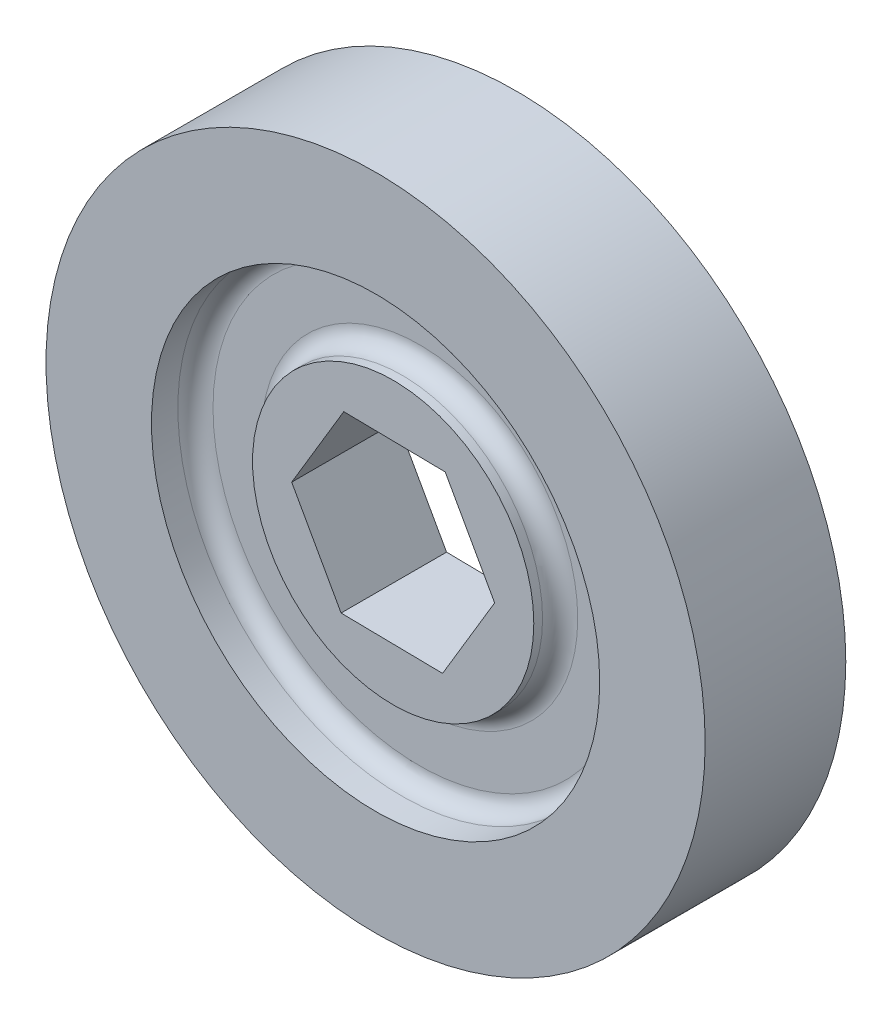
ISO-10303-21;
HEADER;
FILE_DESCRIPTION(('STEP AP214'),'2;1');
FILE_NAME('part.step','',(''),(''),'','','');
FILE_SCHEMA(('AUTOMOTIVE_DESIGN { 1 0 10303 214 1 1 1 1 }'));
ENDSEC;
DATA;
#1=APPLICATION_CONTEXT('core data for automotive mechanical design processes');
#2=APPLICATION_PROTOCOL_DEFINITION('international standard','automotive_design',2000,#1);
#3=PRODUCT_CONTEXT('',#1,'mechanical');
#4=PRODUCT('Part','Part','',(#3));
#5=PRODUCT_RELATED_PRODUCT_CATEGORY('part','',(#4));
#6=PRODUCT_DEFINITION_FORMATION('','',#4);
#7=PRODUCT_DEFINITION_CONTEXT('part definition',#1,'design');
#8=PRODUCT_DEFINITION('design','',#6,#7);
#9=PRODUCT_DEFINITION_SHAPE('','',#8);
#10=(LENGTH_UNIT() NAMED_UNIT(*) SI_UNIT(.MILLI.,.METRE.));
#11=(NAMED_UNIT(*) PLANE_ANGLE_UNIT() SI_UNIT($,.RADIAN.));
#12=(NAMED_UNIT(*) SI_UNIT($,.STERADIAN.) SOLID_ANGLE_UNIT());
#13=UNCERTAINTY_MEASURE_WITH_UNIT(LENGTH_MEASURE(1.E-05),#10,'distance_accuracy_value','');
#14=(GEOMETRIC_REPRESENTATION_CONTEXT(3) GLOBAL_UNCERTAINTY_ASSIGNED_CONTEXT((#13)) GLOBAL_UNIT_ASSIGNED_CONTEXT((#10,
#11,#12)) REPRESENTATION_CONTEXT('',''));
#15=CARTESIAN_POINT('',(0.,0.,0.));
#16=DIRECTION('',(0.,0.,1.));
#17=DIRECTION('',(1.,0.,0.));
#18=AXIS2_PLACEMENT_3D('',#15,#16,#17);
#19=CARTESIAN_POINT('',(-3.76226704796302,-6.29354272196074,10.16));
#20=DIRECTION('',(0.0151994247971552,0.999884482070722,0.));
#21=DIRECTION('',(-0.999884482070722,0.0151994247971552,0.));
#22=AXIS2_PLACEMENT_3D('',#19,#20,#21);
#23=PLANE('',#22);
#24=DIRECTION('',(0.,0.,-1.));
#25=VECTOR('',#24,1.);
#26=CARTESIAN_POINT('',(-3.76226704796302,-6.29354272196074,10.16));
#27=LINE('',#26,#25);
#28=CARTESIAN_POINT('',(-3.76226704796302,-6.29354272196074,8.89));
#29=VERTEX_POINT('',#28);
#30=CARTESIAN_POINT('',(-3.76226704796302,-6.29354272196074,1.27));
#31=VERTEX_POINT('',#30);
#32=EDGE_CURVE('E106',#29,#31,#27,.T.);
#33=ORIENTED_EDGE('',*,*,#32,.F.);
#34=DIRECTION('',(0.999884482070722,-0.0151994247971552,0.));
#35=VECTOR('',#34,1.);
#36=CARTESIAN_POINT('',(-3.76226704796302,-6.29354272196074,8.89));
#37=LINE('',#36,#35);
#38=CARTESIAN_POINT('',(3.56923435303915,-6.40499020033743,8.89));
#39=VERTEX_POINT('',#38);
#40=EDGE_CURVE('E51',#29,#39,#37,.T.);
#41=ORIENTED_EDGE('',*,*,#40,.T.);
#42=DIRECTION('',(0.,0.,-1.));
#43=VECTOR('',#42,1.);
#44=CARTESIAN_POINT('',(3.56923435303915,-6.40499020033743,10.16));
#45=LINE('',#44,#43);
#46=CARTESIAN_POINT('',(3.56923435303915,-6.40499020033743,1.27));
#47=VERTEX_POINT('',#46);
#48=EDGE_CURVE('E117',#39,#47,#45,.T.);
#49=ORIENTED_EDGE('',*,*,#48,.T.);
#50=DIRECTION('',(-0.999884482070722,0.0151994247971552,0.));
#51=VECTOR('',#50,1.);
#52=CARTESIAN_POINT('',(-3.76226704796302,-6.29354272196074,1.27));
#53=LINE('',#52,#51);
#54=EDGE_CURVE('E186',#47,#31,#53,.T.);
#55=ORIENTED_EDGE('',*,*,#54,.T.);
#56=EDGE_LOOP('',(#33,#41,#49,#55));
#57=FACE_BOUND('',#56,.T.);
#58=ADVANCED_FACE('F36',(#57),#23,.T.);
#59=CARTESIAN_POINT('',(3.56923435303915,-6.40499020033743,10.16));
#60=DIRECTION('',(-0.858325649924513,0.513105329032609,0.));
#61=DIRECTION('',(-0.513105329032609,-0.858325649924513,0.));
#62=AXIS2_PLACEMENT_3D('',#59,#60,#61);
#63=PLANE('',#62);
#64=ORIENTED_EDGE('',*,*,#48,.F.);
#65=DIRECTION('',(0.513105329032609,0.858325649924513,0.));
#66=VECTOR('',#65,1.);
#67=CARTESIAN_POINT('',(3.56923435303915,-6.40499020033743,8.89));
#68=LINE('',#67,#66);
#69=CARTESIAN_POINT('',(7.33150140100217,-0.1114474783767,8.89));
#70=VERTEX_POINT('',#69);
#71=EDGE_CURVE('E167',#39,#70,#68,.T.);
#72=ORIENTED_EDGE('',*,*,#71,.T.);
#73=DIRECTION('',(0.,0.,-1.));
#74=VECTOR('',#73,1.);
#75=CARTESIAN_POINT('',(7.33150140100217,-0.1114474783767,10.16));
#76=LINE('',#75,#74);
#77=CARTESIAN_POINT('',(7.33150140100217,-0.1114474783767,1.27));
#78=VERTEX_POINT('',#77);
#79=EDGE_CURVE('E115',#70,#78,#76,.T.);
#80=ORIENTED_EDGE('',*,*,#79,.T.);
#81=DIRECTION('',(-0.513105329032609,-0.858325649924513,0.));
#82=VECTOR('',#81,1.);
#83=CARTESIAN_POINT('',(3.56923435303915,-6.40499020033743,1.27));
#84=LINE('',#83,#82);
#85=EDGE_CURVE('E183',#78,#47,#84,.T.);
#86=ORIENTED_EDGE('',*,*,#85,.T.);
#87=EDGE_LOOP('',(#64,#72,#80,#86));
#88=FACE_BOUND('',#87,.T.);
#89=ADVANCED_FACE('F216',(#88),#63,.T.);
#90=CARTESIAN_POINT('',(7.33150140100217,-0.1114474783767,10.16));
#91=DIRECTION('',(-0.873525074721669,-0.486779153038114,0.));
#92=DIRECTION('',(0.486779153038114,-0.873525074721669,0.));
#93=AXIS2_PLACEMENT_3D('',#90,#91,#92);
#94=PLANE('',#93);
#95=ORIENTED_EDGE('',*,*,#79,.F.);
#96=DIRECTION('',(-0.486779153038114,0.873525074721669,0.));
#97=VECTOR('',#96,1.);
#98=CARTESIAN_POINT('',(7.33150140100217,-0.1114474783767,8.89));
#99=LINE('',#98,#97);
#100=CARTESIAN_POINT('',(3.76226704796302,6.29354272196073,8.89));
#101=VERTEX_POINT('',#100);
#102=EDGE_CURVE('E164',#70,#101,#99,.T.);
#103=ORIENTED_EDGE('',*,*,#102,.T.);
#104=DIRECTION('',(0.,0.,-1.));
#105=VECTOR('',#104,1.);
#106=CARTESIAN_POINT('',(3.76226704796302,6.29354272196073,10.16));
#107=LINE('',#106,#105);
#108=CARTESIAN_POINT('',(3.76226704796302,6.29354272196073,1.27));
#109=VERTEX_POINT('',#108);
#110=EDGE_CURVE('E108',#101,#109,#107,.T.);
#111=ORIENTED_EDGE('',*,*,#110,.T.);
#112=DIRECTION('',(0.486779153038114,-0.873525074721669,0.));
#113=VECTOR('',#112,1.);
#114=CARTESIAN_POINT('',(7.33150140100217,-0.1114474783767,1.27));
#115=LINE('',#114,#113);
#116=EDGE_CURVE('E180',#109,#78,#115,.T.);
#117=ORIENTED_EDGE('',*,*,#116,.T.);
#118=EDGE_LOOP('',(#95,#103,#111,#117));
#119=FACE_BOUND('',#118,.T.);
#120=ADVANCED_FACE('F222',(#119),#94,.T.);
#121=CARTESIAN_POINT('',(3.76226704796302,6.29354272196073,10.16));
#122=DIRECTION('',(-0.0151994247971554,-0.999884482070722,0.));
#123=DIRECTION('',(0.999884482070722,-0.0151994247971554,0.));
#124=AXIS2_PLACEMENT_3D('',#121,#122,#123);
#125=PLANE('',#124);
#126=ORIENTED_EDGE('',*,*,#110,.F.);
#127=DIRECTION('',(-0.999884482070722,0.0151994247971554,0.));
#128=VECTOR('',#127,1.);
#129=CARTESIAN_POINT('',(3.76226704796302,6.29354272196073,8.89));
#130=LINE('',#129,#128);
#131=CARTESIAN_POINT('',(-3.56923435303916,6.40499020033743,8.89));
#132=VERTEX_POINT('',#131);
#133=EDGE_CURVE('E100',#101,#132,#130,.T.);
#134=ORIENTED_EDGE('',*,*,#133,.T.);
#135=DIRECTION('',(0.,0.,-1.));
#136=VECTOR('',#135,1.);
#137=CARTESIAN_POINT('',(-3.56923435303916,6.40499020033743,10.16));
#138=LINE('',#137,#136);
#139=CARTESIAN_POINT('',(-3.56923435303916,6.40499020033743,1.27));
#140=VERTEX_POINT('',#139);
#141=EDGE_CURVE('E99',#132,#140,#138,.T.);
#142=ORIENTED_EDGE('',*,*,#141,.T.);
#143=DIRECTION('',(0.999884482070722,-0.0151994247971554,0.));
#144=VECTOR('',#143,1.);
#145=CARTESIAN_POINT('',(3.76226704796302,6.29354272196073,1.27));
#146=LINE('',#145,#144);
#147=EDGE_CURVE('E177',#140,#109,#146,.T.);
#148=ORIENTED_EDGE('',*,*,#147,.T.);
#149=EDGE_LOOP('',(#126,#134,#142,#148));
#150=FACE_BOUND('',#149,.T.);
#151=ADVANCED_FACE('F228',(#150),#125,.T.);
#152=CARTESIAN_POINT('',(-3.56923435303916,6.40499020033743,10.16));
#153=DIRECTION('',(0.858325649924514,-0.513105329032609,0.));
#154=DIRECTION('',(0.513105329032609,0.858325649924514,0.));
#155=AXIS2_PLACEMENT_3D('',#152,#153,#154);
#156=PLANE('',#155);
#157=ORIENTED_EDGE('',*,*,#141,.F.);
#158=DIRECTION('',(-0.513105329032609,-0.858325649924514,0.));
#159=VECTOR('',#158,1.);
#160=CARTESIAN_POINT('',(-3.56923435303916,6.40499020033743,8.89));
#161=LINE('',#160,#159);
#162=CARTESIAN_POINT('',(-7.33150140100217,0.111447478376703,8.89));
#163=VERTEX_POINT('',#162);
#164=EDGE_CURVE('E91',#132,#163,#161,.T.);
#165=ORIENTED_EDGE('',*,*,#164,.T.);
#166=DIRECTION('',(0.,0.,-1.));
#167=VECTOR('',#166,1.);
#168=CARTESIAN_POINT('',(-7.33150140100217,0.111447478376703,10.16));
#169=LINE('',#168,#167);
#170=CARTESIAN_POINT('',(-7.33150140100217,0.111447478376703,1.27));
#171=VERTEX_POINT('',#170);
#172=EDGE_CURVE('E59',#163,#171,#169,.T.);
#173=ORIENTED_EDGE('',*,*,#172,.T.);
#174=DIRECTION('',(0.513105329032609,0.858325649924514,0.));
#175=VECTOR('',#174,1.);
#176=CARTESIAN_POINT('',(-3.56923435303916,6.40499020033743,1.27));
#177=LINE('',#176,#175);
#178=EDGE_CURVE('E175',#171,#140,#177,.T.);
#179=ORIENTED_EDGE('',*,*,#178,.T.);
#180=EDGE_LOOP('',(#157,#165,#173,#179));
#181=FACE_BOUND('',#180,.T.);
#182=ADVANCED_FACE('F98',(#181),#156,.T.);
#183=CARTESIAN_POINT('',(-7.33150140100217,0.111447478376703,10.16));
#184=DIRECTION('',(0.873525074721669,0.486779153038113,0.));
#185=DIRECTION('',(-0.486779153038113,0.873525074721669,0.));
#186=AXIS2_PLACEMENT_3D('',#183,#184,#185);
#187=PLANE('',#186);
#188=ORIENTED_EDGE('',*,*,#172,.F.);
#189=DIRECTION('',(0.486779153038113,-0.873525074721669,0.));
#190=VECTOR('',#189,1.);
#191=CARTESIAN_POINT('',(-7.33150140100217,0.111447478376703,8.89));
#192=LINE('',#191,#190);
#193=EDGE_CURVE('E88',#163,#29,#192,.T.);
#194=ORIENTED_EDGE('',*,*,#193,.T.);
#195=ORIENTED_EDGE('',*,*,#32,.T.);
#196=DIRECTION('',(-0.486779153038113,0.873525074721669,0.));
#197=VECTOR('',#196,1.);
#198=CARTESIAN_POINT('',(-7.33150140100217,0.111447478376703,1.27));
#199=LINE('',#198,#197);
#200=EDGE_CURVE('E105',#31,#171,#199,.T.);
#201=ORIENTED_EDGE('',*,*,#200,.T.);
#202=EDGE_LOOP('',(#188,#194,#195,#201));
#203=FACE_BOUND('',#202,.T.);
#204=ADVANCED_FACE('F103',(#203),#187,.T.);
#205=CARTESIAN_POINT('',(0.,0.,6.985));
#206=DIRECTION('',(0.,0.,1.));
#207=DIRECTION('',(1.,0.,0.));
#208=AXIS2_PLACEMENT_3D('',#205,#206,#207);
#209=CYLINDRICAL_SURFACE('',#208,10.16);
#210=CARTESIAN_POINT('',(0.,0.,8.255));
#211=DIRECTION('',(0.,0.,1.));
#212=DIRECTION('',(1.,0.,0.));
#213=AXIS2_PLACEMENT_3D('',#210,#211,#212);
#214=CIRCLE('',#213,10.16);
#215=CARTESIAN_POINT('',(10.16,0.,8.255));
#216=VERTEX_POINT('',#215);
#217=EDGE_CURVE('E137',#216,#216,#214,.T.);
#218=ORIENTED_EDGE('',*,*,#217,.T.);
#219=EDGE_LOOP('',(#218));
#220=FACE_BOUND('',#219,.T.);
#221=CARTESIAN_POINT('',(0.,0.,8.89));
#222=DIRECTION('',(0.,0.,1.));
#223=DIRECTION('',(1.,0.,0.));
#224=AXIS2_PLACEMENT_3D('',#221,#222,#223);
#225=CIRCLE('',#224,10.16);
#226=CARTESIAN_POINT('',(10.16,0.,8.89));
#227=VERTEX_POINT('',#226);
#228=EDGE_CURVE('E95',#227,#227,#225,.T.);
#229=ORIENTED_EDGE('',*,*,#228,.F.);
#230=EDGE_LOOP('',(#229));
#231=FACE_BOUND('',#230,.T.);
#232=ADVANCED_FACE('F154',(#220,#231),#209,.T.);
#233=CARTESIAN_POINT('',(0.,0.,3.175));
#234=DIRECTION('',(0.,0.,-1.));
#235=DIRECTION('',(-1.,0.,0.));
#236=AXIS2_PLACEMENT_3D('',#233,#234,#235);
#237=CYLINDRICAL_SURFACE('',#236,10.16);
#238=CARTESIAN_POINT('',(0.,0.,1.905));
#239=DIRECTION('',(0.,0.,-1.));
#240=DIRECTION('',(-1.,0.,0.));
#241=AXIS2_PLACEMENT_3D('',#238,#239,#240);
#242=CIRCLE('',#241,10.16);
#243=CARTESIAN_POINT('',(-10.16,0.,1.905));
#244=VERTEX_POINT('',#243);
#245=EDGE_CURVE('E123',#244,#244,#242,.T.);
#246=ORIENTED_EDGE('',*,*,#245,.T.);
#247=EDGE_LOOP('',(#246));
#248=FACE_BOUND('',#247,.T.);
#249=CARTESIAN_POINT('',(0.,0.,1.27));
#250=DIRECTION('',(0.,0.,-1.));
#251=DIRECTION('',(-1.,0.,0.));
#252=AXIS2_PLACEMENT_3D('',#249,#250,#251);
#253=CIRCLE('',#252,10.16);
#254=CARTESIAN_POINT('',(-10.16,0.,1.27));
#255=VERTEX_POINT('',#254);
#256=EDGE_CURVE('E171',#255,#255,#253,.T.);
#257=ORIENTED_EDGE('',*,*,#256,.F.);
#258=EDGE_LOOP('',(#257));
#259=FACE_BOUND('',#258,.T.);
#260=ADVANCED_FACE('F157',(#248,#259),#237,.T.);
#261=CARTESIAN_POINT('',(0.,0.,10.16));
#262=DIRECTION('',(0.,0.,1.));
#263=DIRECTION('',(1.,0.,0.));
#264=AXIS2_PLACEMENT_3D('',#261,#262,#263);
#265=PLANE('',#264);
#266=CARTESIAN_POINT('',(0.,0.,10.16));
#267=DIRECTION('',(0.,0.,1.));
#268=DIRECTION('',(1.,0.,0.));
#269=AXIS2_PLACEMENT_3D('',#266,#267,#268);
#270=CIRCLE('',#269,16.1925);
#271=CARTESIAN_POINT('',(16.1925,0.,10.16));
#272=VERTEX_POINT('',#271);
#273=EDGE_CURVE('E110',#272,#272,#270,.T.);
#274=ORIENTED_EDGE('',*,*,#273,.F.);
#275=EDGE_LOOP('',(#274));
#276=FACE_BOUND('',#275,.T.);
#277=CARTESIAN_POINT('',(0.,0.,10.16));
#278=DIRECTION('',(0.,0.,1.));
#279=DIRECTION('',(1.,0.,0.));
#280=AXIS2_PLACEMENT_3D('',#277,#278,#279);
#281=CIRCLE('',#280,23.8125);
#282=CARTESIAN_POINT('',(23.8125,0.,10.16));
#283=VERTEX_POINT('',#282);
#284=EDGE_CURVE('E120',#283,#283,#281,.T.);
#285=ORIENTED_EDGE('',*,*,#284,.T.);
#286=EDGE_LOOP('',(#285));
#287=FACE_BOUND('',#286,.T.);
#288=ADVANCED_FACE('F196',(#276,#287),#265,.T.);
#289=CARTESIAN_POINT('',(0.,0.,0.));
#290=DIRECTION('',(0.,0.,1.));
#291=DIRECTION('',(1.,0.,0.));
#292=AXIS2_PLACEMENT_3D('',#289,#290,#291);
#293=PLANE('',#292);
#294=CARTESIAN_POINT('',(0.,0.,0.));
#295=DIRECTION('',(0.,0.,-1.));
#296=DIRECTION('',(-1.,0.,0.));
#297=AXIS2_PLACEMENT_3D('',#294,#295,#296);
#298=CIRCLE('',#297,16.1925);
#299=CARTESIAN_POINT('',(-16.1925,0.,0.));
#300=VERTEX_POINT('',#299);
#301=EDGE_CURVE('E189',#300,#300,#298,.T.);
#302=ORIENTED_EDGE('',*,*,#301,.F.);
#303=EDGE_LOOP('',(#302));
#304=FACE_BOUND('',#303,.T.);
#305=CARTESIAN_POINT('',(0.,0.,0.));
#306=DIRECTION('',(0.,0.,1.));
#307=DIRECTION('',(1.,0.,0.));
#308=AXIS2_PLACEMENT_3D('',#305,#306,#307);
#309=CIRCLE('',#308,23.8125);
#310=CARTESIAN_POINT('',(23.8125,0.,0.));
#311=VERTEX_POINT('',#310);
#312=EDGE_CURVE('E119',#311,#311,#309,.T.);
#313=ORIENTED_EDGE('',*,*,#312,.F.);
#314=EDGE_LOOP('',(#313));
#315=FACE_BOUND('',#314,.T.);
#316=ADVANCED_FACE('F199',(#304,#315),#293,.F.);
#317=CARTESIAN_POINT('',(0.,0.,10.16));
#318=DIRECTION('',(0.,0.,-1.));
#319=DIRECTION('',(-1.,0.,0.));
#320=AXIS2_PLACEMENT_3D('',#317,#318,#319);
#321=CYLINDRICAL_SURFACE('',#320,23.8125);
#322=ORIENTED_EDGE('',*,*,#284,.F.);
#323=EDGE_LOOP('',(#322));
#324=FACE_BOUND('',#323,.T.);
#325=ORIENTED_EDGE('',*,*,#312,.T.);
#326=EDGE_LOOP('',(#325));
#327=FACE_BOUND('',#326,.T.);
#328=ADVANCED_FACE('F203',(#324,#327),#321,.T.);
#329=CARTESIAN_POINT('',(0.,0.,6.985));
#330=DIRECTION('',(0.,0.,1.));
#331=DIRECTION('',(1.,0.,0.));
#332=AXIS2_PLACEMENT_3D('',#329,#330,#331);
#333=CYLINDRICAL_SURFACE('',#332,16.1925);
#334=CARTESIAN_POINT('',(0.,0.,8.255));
#335=DIRECTION('',(0.,0.,1.));
#336=DIRECTION('',(1.,0.,0.));
#337=AXIS2_PLACEMENT_3D('',#334,#335,#336);
#338=CIRCLE('',#337,16.1925);
#339=CARTESIAN_POINT('',(16.1925,0.,8.255));
#340=VERTEX_POINT('',#339);
#341=EDGE_CURVE('E11',#340,#340,#338,.F.);
#342=ORIENTED_EDGE('',*,*,#341,.T.);
#343=EDGE_LOOP('',(#342));
#344=FACE_BOUND('',#343,.T.);
#345=ORIENTED_EDGE('',*,*,#273,.T.);
#346=EDGE_LOOP('',(#345));
#347=FACE_BOUND('',#346,.T.);
#348=ADVANCED_FACE('F194',(#344,#347),#333,.F.);
#349=CARTESIAN_POINT('',(0.,0.,6.985));
#350=DIRECTION('',(0.,0.,1.));
#351=DIRECTION('',(1.,0.,0.));
#352=AXIS2_PLACEMENT_3D('',#349,#350,#351);
#353=PLANE('',#352);
#354=CARTESIAN_POINT('',(0.,0.,6.985));
#355=DIRECTION('',(0.,0.,1.));
#356=DIRECTION('',(1.,0.,0.));
#357=AXIS2_PLACEMENT_3D('',#354,#355,#356);
#358=CIRCLE('',#357,11.43);
#359=CARTESIAN_POINT('',(11.43,0.,6.985));
#360=VERTEX_POINT('',#359);
#361=EDGE_CURVE('E44',#360,#360,#358,.F.);
#362=ORIENTED_EDGE('',*,*,#361,.T.);
#363=EDGE_LOOP('',(#362));
#364=FACE_BOUND('',#363,.T.);
#365=CARTESIAN_POINT('',(0.,0.,6.985));
#366=DIRECTION('',(0.,0.,1.));
#367=DIRECTION('',(1.,0.,0.));
#368=AXIS2_PLACEMENT_3D('',#365,#366,#367);
#369=CIRCLE('',#368,14.9225);
#370=CARTESIAN_POINT('',(14.9225,0.,6.985));
#371=VERTEX_POINT('',#370);
#372=EDGE_CURVE('E140',#371,#371,#369,.T.);
#373=ORIENTED_EDGE('',*,*,#372,.T.);
#374=EDGE_LOOP('',(#373));
#375=FACE_BOUND('',#374,.T.);
#376=ADVANCED_FACE('F145',(#364,#375),#353,.T.);
#377=CARTESIAN_POINT('',(0.,0.,3.175));
#378=DIRECTION('',(0.,0.,-1.));
#379=DIRECTION('',(-1.,0.,0.));
#380=AXIS2_PLACEMENT_3D('',#377,#378,#379);
#381=CYLINDRICAL_SURFACE('',#380,16.1925);
#382=CARTESIAN_POINT('',(0.,0.,1.905));
#383=DIRECTION('',(0.,0.,-1.));
#384=DIRECTION('',(-1.,0.,0.));
#385=AXIS2_PLACEMENT_3D('',#382,#383,#384);
#386=CIRCLE('',#385,16.1925);
#387=CARTESIAN_POINT('',(-16.1925,0.,1.905));
#388=VERTEX_POINT('',#387);
#389=EDGE_CURVE('E134',#388,#388,#386,.F.);
#390=ORIENTED_EDGE('',*,*,#389,.T.);
#391=EDGE_LOOP('',(#390));
#392=FACE_BOUND('',#391,.T.);
#393=ORIENTED_EDGE('',*,*,#301,.T.);
#394=EDGE_LOOP('',(#393));
#395=FACE_BOUND('',#394,.T.);
#396=ADVANCED_FACE('F241',(#392,#395),#381,.F.);
#397=CARTESIAN_POINT('',(0.,0.,3.175));
#398=DIRECTION('',(0.,0.,-1.));
#399=DIRECTION('',(-1.,0.,0.));
#400=AXIS2_PLACEMENT_3D('',#397,#398,#399);
#401=PLANE('',#400);
#402=CARTESIAN_POINT('',(0.,0.,3.175));
#403=DIRECTION('',(0.,0.,-1.));
#404=DIRECTION('',(-1.,0.,0.));
#405=AXIS2_PLACEMENT_3D('',#402,#403,#404);
#406=CIRCLE('',#405,11.43);
#407=CARTESIAN_POINT('',(-11.43,0.,3.175));
#408=VERTEX_POINT('',#407);
#409=EDGE_CURVE('E131',#408,#408,#406,.F.);
#410=ORIENTED_EDGE('',*,*,#409,.T.);
#411=EDGE_LOOP('',(#410));
#412=FACE_BOUND('',#411,.T.);
#413=CARTESIAN_POINT('',(0.,0.,3.175));
#414=DIRECTION('',(0.,0.,-1.));
#415=DIRECTION('',(-1.,0.,0.));
#416=AXIS2_PLACEMENT_3D('',#413,#414,#415);
#417=CIRCLE('',#416,14.9225);
#418=CARTESIAN_POINT('',(-14.9225,0.,3.175));
#419=VERTEX_POINT('',#418);
#420=EDGE_CURVE('E128',#419,#419,#417,.T.);
#421=ORIENTED_EDGE('',*,*,#420,.T.);
#422=EDGE_LOOP('',(#421));
#423=FACE_BOUND('',#422,.T.);
#424=ADVANCED_FACE('F245',(#412,#423),#401,.T.);
#425=CARTESIAN_POINT('',(0.,0.,1.27));
#426=DIRECTION('',(0.,0.,-1.));
#427=DIRECTION('',(-1.,0.,0.));
#428=AXIS2_PLACEMENT_3D('',#425,#426,#427);
#429=PLANE('',#428);
#430=ORIENTED_EDGE('',*,*,#85,.F.);
#431=ORIENTED_EDGE('',*,*,#116,.F.);
#432=ORIENTED_EDGE('',*,*,#147,.F.);
#433=ORIENTED_EDGE('',*,*,#178,.F.);
#434=ORIENTED_EDGE('',*,*,#200,.F.);
#435=ORIENTED_EDGE('',*,*,#54,.F.);
#436=EDGE_LOOP('',(#430,#431,#432,#433,#434,#435));
#437=FACE_BOUND('',#436,.T.);
#438=ORIENTED_EDGE('',*,*,#256,.T.);
#439=EDGE_LOOP('',(#438));
#440=FACE_BOUND('',#439,.T.);
#441=ADVANCED_FACE('F249',(#437,#440),#429,.T.);
#442=CARTESIAN_POINT('',(0.,0.,8.89));
#443=DIRECTION('',(0.,0.,1.));
#444=DIRECTION('',(1.,0.,0.));
#445=AXIS2_PLACEMENT_3D('',#442,#443,#444);
#446=PLANE('',#445);
#447=ORIENTED_EDGE('',*,*,#193,.F.);
#448=ORIENTED_EDGE('',*,*,#164,.F.);
#449=ORIENTED_EDGE('',*,*,#133,.F.);
#450=ORIENTED_EDGE('',*,*,#102,.F.);
#451=ORIENTED_EDGE('',*,*,#71,.F.);
#452=ORIENTED_EDGE('',*,*,#40,.F.);
#453=EDGE_LOOP('',(#447,#448,#449,#450,#451,#452));
#454=FACE_BOUND('',#453,.T.);
#455=ORIENTED_EDGE('',*,*,#228,.T.);
#456=EDGE_LOOP('',(#455));
#457=FACE_BOUND('',#456,.T.);
#458=ADVANCED_FACE('F89',(#454,#457),#446,.T.);
#459=CARTESIAN_POINT('',(0.,0.,1.905));
#460=DIRECTION('',(0.,0.,-1.));
#461=DIRECTION('',(-1.,0.,0.));
#462=AXIS2_PLACEMENT_3D('',#459,#460,#461);
#463=TOROIDAL_SURFACE('',#462,11.43,1.27);
#464=ORIENTED_EDGE('',*,*,#409,.F.);
#465=EDGE_LOOP('',(#464));
#466=FACE_BOUND('',#465,.T.);
#467=ORIENTED_EDGE('',*,*,#245,.F.);
#468=EDGE_LOOP('',(#467));
#469=FACE_BOUND('',#468,.T.);
#470=ADVANCED_FACE('F258',(#466,#469),#463,.F.);
#471=CARTESIAN_POINT('',(0.,0.,1.905));
#472=DIRECTION('',(0.,0.,-1.));
#473=DIRECTION('',(-1.,0.,0.));
#474=AXIS2_PLACEMENT_3D('',#471,#472,#473);
#475=TOROIDAL_SURFACE('',#474,14.9225,1.27);
#476=ORIENTED_EDGE('',*,*,#389,.F.);
#477=EDGE_LOOP('',(#476));
#478=FACE_BOUND('',#477,.T.);
#479=ORIENTED_EDGE('',*,*,#420,.F.);
#480=EDGE_LOOP('',(#479));
#481=FACE_BOUND('',#480,.T.);
#482=ADVANCED_FACE('F151',(#478,#481),#475,.F.);
#483=CARTESIAN_POINT('',(0.,0.,8.255));
#484=DIRECTION('',(0.,0.,1.));
#485=DIRECTION('',(1.,0.,0.));
#486=AXIS2_PLACEMENT_3D('',#483,#484,#485);
#487=TOROIDAL_SURFACE('',#486,11.43,1.27);
#488=ORIENTED_EDGE('',*,*,#361,.F.);
#489=EDGE_LOOP('',(#488));
#490=FACE_BOUND('',#489,.T.);
#491=ORIENTED_EDGE('',*,*,#217,.F.);
#492=EDGE_LOOP('',(#491));
#493=FACE_BOUND('',#492,.T.);
#494=ADVANCED_FACE('F148',(#490,#493),#487,.F.);
#495=CARTESIAN_POINT('',(0.,0.,8.255));
#496=DIRECTION('',(0.,0.,1.));
#497=DIRECTION('',(1.,0.,0.));
#498=AXIS2_PLACEMENT_3D('',#495,#496,#497);
#499=TOROIDAL_SURFACE('',#498,14.9225,1.27);
#500=ORIENTED_EDGE('',*,*,#341,.F.);
#501=EDGE_LOOP('',(#500));
#502=FACE_BOUND('',#501,.T.);
#503=ORIENTED_EDGE('',*,*,#372,.F.);
#504=EDGE_LOOP('',(#503));
#505=FACE_BOUND('',#504,.T.);
#506=ADVANCED_FACE('F38',(#502,#505),#499,.F.);
#507=CLOSED_SHELL('',(#58,#89,#120,#151,#182,#204,#232,#260,#288,#316,#328,#348,#376,#396,#424,
#441,#458,#470,#482,#494,#506));
#508=MANIFOLD_SOLID_BREP('B2',#507);
#509=ADVANCED_BREP_SHAPE_REPRESENTATION('',(#18,#508),#14);
#510=SHAPE_DEFINITION_REPRESENTATION(#9,#509);
ENDSEC;
END-ISO-10303-21;
